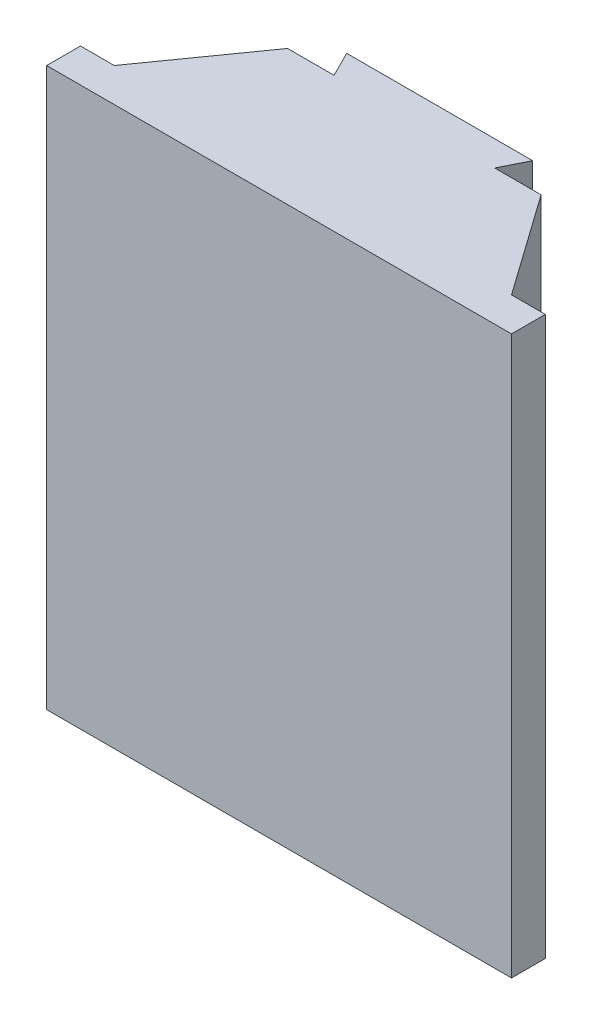
ISO-10303-21;
HEADER;
FILE_DESCRIPTION(('STEP AP214'),'2;1');
FILE_NAME('part.step','',(''),(''),'','','');
FILE_SCHEMA(('AUTOMOTIVE_DESIGN { 1 0 10303 214 1 1 1 1 }'));
ENDSEC;
DATA;
#1=APPLICATION_CONTEXT('core data for automotive mechanical design processes');
#2=APPLICATION_PROTOCOL_DEFINITION('international standard','automotive_design',2000,#1);
#3=PRODUCT_CONTEXT('',#1,'mechanical');
#4=PRODUCT('Part','Part','',(#3));
#5=PRODUCT_RELATED_PRODUCT_CATEGORY('part','',(#4));
#6=PRODUCT_DEFINITION_FORMATION('','',#4);
#7=PRODUCT_DEFINITION_CONTEXT('part definition',#1,'design');
#8=PRODUCT_DEFINITION('design','',#6,#7);
#9=PRODUCT_DEFINITION_SHAPE('','',#8);
#10=(LENGTH_UNIT() NAMED_UNIT(*) SI_UNIT(.MILLI.,.METRE.));
#11=(NAMED_UNIT(*) PLANE_ANGLE_UNIT() SI_UNIT($,.RADIAN.));
#12=(NAMED_UNIT(*) SI_UNIT($,.STERADIAN.) SOLID_ANGLE_UNIT());
#13=UNCERTAINTY_MEASURE_WITH_UNIT(LENGTH_MEASURE(1.E-05),#10,'distance_accuracy_value','');
#14=(GEOMETRIC_REPRESENTATION_CONTEXT(3) GLOBAL_UNCERTAINTY_ASSIGNED_CONTEXT((#13)) GLOBAL_UNIT_ASSIGNED_CONTEXT((#10,
#11,#12)) REPRESENTATION_CONTEXT('',''));
#15=CARTESIAN_POINT('',(0.,0.,0.));
#16=DIRECTION('',(0.,0.,1.));
#17=DIRECTION('',(1.,0.,0.));
#18=AXIS2_PLACEMENT_3D('',#15,#16,#17);
#19=CARTESIAN_POINT('',(-137.5,165.,156.));
#20=DIRECTION('',(1.,0.,0.));
#21=DIRECTION('',(0.,0.,-1.));
#22=AXIS2_PLACEMENT_3D('',#19,#20,#21);
#23=PLANE('',#22);
#24=DIRECTION('',(0.,0.,1.));
#25=VECTOR('',#24,1.);
#26=CARTESIAN_POINT('',(-137.5,-165.,156.));
#27=LINE('',#26,#25);
#28=CARTESIAN_POINT('',(-137.5,-165.,136.));
#29=VERTEX_POINT('',#28);
#30=CARTESIAN_POINT('',(-137.5,-165.,156.));
#31=VERTEX_POINT('',#30);
#32=EDGE_CURVE('E154',#29,#31,#27,.T.);
#33=ORIENTED_EDGE('',*,*,#32,.T.);
#34=DIRECTION('',(0.,-1.,0.));
#35=VECTOR('',#34,1.);
#36=CARTESIAN_POINT('',(-137.5,165.,156.));
#37=LINE('',#36,#35);
#38=CARTESIAN_POINT('',(-137.5,165.,156.));
#39=VERTEX_POINT('',#38);
#40=EDGE_CURVE('E11',#39,#31,#37,.T.);
#41=ORIENTED_EDGE('',*,*,#40,.F.);
#42=DIRECTION('',(0.,0.,1.));
#43=VECTOR('',#42,1.);
#44=CARTESIAN_POINT('',(-137.5,165.,156.));
#45=LINE('',#44,#43);
#46=CARTESIAN_POINT('',(-137.5,165.,136.));
#47=VERTEX_POINT('',#46);
#48=EDGE_CURVE('E176',#47,#39,#45,.T.);
#49=ORIENTED_EDGE('',*,*,#48,.F.);
#50=DIRECTION('',(0.,-1.,0.));
#51=VECTOR('',#50,1.);
#52=CARTESIAN_POINT('',(-137.5,165.,136.));
#53=LINE('',#52,#51);
#54=EDGE_CURVE('E150',#47,#29,#53,.T.);
#55=ORIENTED_EDGE('',*,*,#54,.T.);
#56=EDGE_LOOP('',(#33,#41,#49,#55));
#57=FACE_BOUND('',#56,.T.);
#58=ADVANCED_FACE('F34',(#57),#23,.F.);
#59=CARTESIAN_POINT('',(-137.5,165.,156.));
#60=DIRECTION('',(0.,0.,-1.));
#61=DIRECTION('',(-1.,0.,0.));
#62=AXIS2_PLACEMENT_3D('',#59,#60,#61);
#63=PLANE('',#62);
#64=DIRECTION('',(1.,0.,0.));
#65=VECTOR('',#64,1.);
#66=CARTESIAN_POINT('',(-137.5,-165.,156.));
#67=LINE('',#66,#65);
#68=CARTESIAN_POINT('',(137.5,-165.,156.));
#69=VERTEX_POINT('',#68);
#70=EDGE_CURVE('E157',#31,#69,#67,.T.);
#71=ORIENTED_EDGE('',*,*,#70,.T.);
#72=DIRECTION('',(0.,-1.,0.));
#73=VECTOR('',#72,1.);
#74=CARTESIAN_POINT('',(137.5,165.,156.));
#75=LINE('',#74,#73);
#76=CARTESIAN_POINT('',(137.5,165.,156.));
#77=VERTEX_POINT('',#76);
#78=EDGE_CURVE('E42',#77,#69,#75,.T.);
#79=ORIENTED_EDGE('',*,*,#78,.F.);
#80=DIRECTION('',(1.,0.,0.));
#81=VECTOR('',#80,1.);
#82=CARTESIAN_POINT('',(-137.5,165.,156.));
#83=LINE('',#82,#81);
#84=EDGE_CURVE('E105',#39,#77,#83,.T.);
#85=ORIENTED_EDGE('',*,*,#84,.F.);
#86=ORIENTED_EDGE('',*,*,#40,.T.);
#87=EDGE_LOOP('',(#71,#79,#85,#86));
#88=FACE_BOUND('',#87,.T.);
#89=ADVANCED_FACE('F254',(#88),#63,.F.);
#90=CARTESIAN_POINT('',(137.5,165.,156.));
#91=DIRECTION('',(-1.,0.,0.));
#92=DIRECTION('',(0.,0.,1.));
#93=AXIS2_PLACEMENT_3D('',#90,#91,#92);
#94=PLANE('',#93);
#95=DIRECTION('',(0.,0.,-1.));
#96=VECTOR('',#95,1.);
#97=CARTESIAN_POINT('',(137.5,-165.,156.));
#98=LINE('',#97,#96);
#99=CARTESIAN_POINT('',(137.5,-165.,136.));
#100=VERTEX_POINT('',#99);
#101=EDGE_CURVE('E159',#69,#100,#98,.T.);
#102=ORIENTED_EDGE('',*,*,#101,.T.);
#103=DIRECTION('',(0.,-1.,0.));
#104=VECTOR('',#103,1.);
#105=CARTESIAN_POINT('',(137.5,165.,136.));
#106=LINE('',#105,#104);
#107=CARTESIAN_POINT('',(137.5,165.,136.));
#108=VERTEX_POINT('',#107);
#109=EDGE_CURVE('E195',#108,#100,#106,.T.);
#110=ORIENTED_EDGE('',*,*,#109,.F.);
#111=DIRECTION('',(0.,0.,-1.));
#112=VECTOR('',#111,1.);
#113=CARTESIAN_POINT('',(137.5,165.,156.));
#114=LINE('',#113,#112);
#115=EDGE_CURVE('E203',#77,#108,#114,.T.);
#116=ORIENTED_EDGE('',*,*,#115,.F.);
#117=ORIENTED_EDGE('',*,*,#78,.T.);
#118=EDGE_LOOP('',(#102,#110,#116,#117));
#119=FACE_BOUND('',#118,.T.);
#120=ADVANCED_FACE('F201',(#119),#94,.F.);
#121=CARTESIAN_POINT('',(137.5,165.,136.));
#122=DIRECTION('',(0.,0.,1.));
#123=DIRECTION('',(1.,0.,0.));
#124=AXIS2_PLACEMENT_3D('',#121,#122,#123);
#125=PLANE('',#124);
#126=DIRECTION('',(-1.,0.,0.));
#127=VECTOR('',#126,1.);
#128=CARTESIAN_POINT('',(137.5,-165.,136.));
#129=LINE('',#128,#127);
#130=CARTESIAN_POINT('',(117.5,-165.,136.));
#131=VERTEX_POINT('',#130);
#132=EDGE_CURVE('E161',#100,#131,#129,.T.);
#133=ORIENTED_EDGE('',*,*,#132,.T.);
#134=DIRECTION('',(0.,-1.,0.));
#135=VECTOR('',#134,1.);
#136=CARTESIAN_POINT('',(117.5,165.,136.));
#137=LINE('',#136,#135);
#138=CARTESIAN_POINT('',(117.5,165.,136.));
#139=VERTEX_POINT('',#138);
#140=EDGE_CURVE('E192',#139,#131,#137,.T.);
#141=ORIENTED_EDGE('',*,*,#140,.F.);
#142=DIRECTION('',(-1.,0.,0.));
#143=VECTOR('',#142,1.);
#144=CARTESIAN_POINT('',(137.5,165.,136.));
#145=LINE('',#144,#143);
#146=EDGE_CURVE('E221',#108,#139,#145,.T.);
#147=ORIENTED_EDGE('',*,*,#146,.F.);
#148=ORIENTED_EDGE('',*,*,#109,.T.);
#149=EDGE_LOOP('',(#133,#141,#147,#148));
#150=FACE_BOUND('',#149,.T.);
#151=ADVANCED_FACE('F212',(#150),#125,.F.);
#152=CARTESIAN_POINT('',(117.5,165.,136.));
#153=DIRECTION('',(-0.816024481101655,0.,0.57801734078034));
#154=DIRECTION('',(0.57801734078034,0.,0.816024481101655));
#155=AXIS2_PLACEMENT_3D('',#152,#153,#154);
#156=PLANE('',#155);
#157=DIRECTION('',(-0.57801734078034,0.,-0.816024481101655));
#158=VECTOR('',#157,1.);
#159=CARTESIAN_POINT('',(117.5,-165.,136.));
#160=LINE('',#159,#158);
#161=CARTESIAN_POINT('',(75.,-165.,76.));
#162=VERTEX_POINT('',#161);
#163=EDGE_CURVE('E163',#131,#162,#160,.T.);
#164=ORIENTED_EDGE('',*,*,#163,.T.);
#165=DIRECTION('',(0.,-1.,0.));
#166=VECTOR('',#165,1.);
#167=CARTESIAN_POINT('',(75.,165.,76.));
#168=LINE('',#167,#166);
#169=CARTESIAN_POINT('',(75.,165.,76.));
#170=VERTEX_POINT('',#169);
#171=EDGE_CURVE('E189',#170,#162,#168,.T.);
#172=ORIENTED_EDGE('',*,*,#171,.F.);
#173=DIRECTION('',(-0.57801734078034,0.,-0.816024481101655));
#174=VECTOR('',#173,1.);
#175=CARTESIAN_POINT('',(117.5,165.,136.));
#176=LINE('',#175,#174);
#177=EDGE_CURVE('E218',#139,#170,#176,.T.);
#178=ORIENTED_EDGE('',*,*,#177,.F.);
#179=ORIENTED_EDGE('',*,*,#140,.T.);
#180=EDGE_LOOP('',(#164,#172,#178,#179));
#181=FACE_BOUND('',#180,.T.);
#182=ADVANCED_FACE('F216',(#181),#156,.F.);
#183=CARTESIAN_POINT('',(75.,165.,76.));
#184=DIRECTION('',(0.,0.,1.));
#185=DIRECTION('',(1.,0.,0.));
#186=AXIS2_PLACEMENT_3D('',#183,#184,#185);
#187=PLANE('',#186);
#188=DIRECTION('',(-1.,0.,0.));
#189=VECTOR('',#188,1.);
#190=CARTESIAN_POINT('',(75.,-165.,76.));
#191=LINE('',#190,#189);
#192=CARTESIAN_POINT('',(47.5,-165.,76.));
#193=VERTEX_POINT('',#192);
#194=EDGE_CURVE('E165',#162,#193,#191,.T.);
#195=ORIENTED_EDGE('',*,*,#194,.T.);
#196=DIRECTION('',(0.,-1.,0.));
#197=VECTOR('',#196,1.);
#198=CARTESIAN_POINT('',(47.5,165.,76.));
#199=LINE('',#198,#197);
#200=CARTESIAN_POINT('',(47.5,165.,76.));
#201=VERTEX_POINT('',#200);
#202=EDGE_CURVE('E186',#201,#193,#199,.T.);
#203=ORIENTED_EDGE('',*,*,#202,.F.);
#204=DIRECTION('',(-1.,0.,0.));
#205=VECTOR('',#204,1.);
#206=CARTESIAN_POINT('',(75.,165.,76.));
#207=LINE('',#206,#205);
#208=EDGE_CURVE('E220',#170,#201,#207,.T.);
#209=ORIENTED_EDGE('',*,*,#208,.F.);
#210=ORIENTED_EDGE('',*,*,#171,.T.);
#211=EDGE_LOOP('',(#195,#203,#209,#210));
#212=FACE_BOUND('',#211,.T.);
#213=ADVANCED_FACE('F267',(#212),#187,.F.);
#214=CARTESIAN_POINT('',(47.5,165.,76.));
#215=DIRECTION('',(-0.894427190999916,0.,-0.447213595499958));
#216=DIRECTION('',(-0.447213595499958,0.,0.894427190999916));
#217=AXIS2_PLACEMENT_3D('',#214,#215,#216);
#218=PLANE('',#217);
#219=DIRECTION('',(0.447213595499958,0.,-0.894427190999916));
#220=VECTOR('',#219,1.);
#221=CARTESIAN_POINT('',(47.5,-165.,76.));
#222=LINE('',#221,#220);
#223=CARTESIAN_POINT('',(55.,-165.,61.));
#224=VERTEX_POINT('',#223);
#225=EDGE_CURVE('E167',#193,#224,#222,.T.);
#226=ORIENTED_EDGE('',*,*,#225,.T.);
#227=DIRECTION('',(0.,-1.,0.));
#228=VECTOR('',#227,1.);
#229=CARTESIAN_POINT('',(55.,165.,61.));
#230=LINE('',#229,#228);
#231=CARTESIAN_POINT('',(55.,165.,61.));
#232=VERTEX_POINT('',#231);
#233=EDGE_CURVE('E183',#232,#224,#230,.T.);
#234=ORIENTED_EDGE('',*,*,#233,.F.);
#235=DIRECTION('',(0.447213595499958,0.,-0.894427190999916));
#236=VECTOR('',#235,1.);
#237=CARTESIAN_POINT('',(47.5,165.,76.));
#238=LINE('',#237,#236);
#239=EDGE_CURVE('E223',#201,#232,#238,.T.);
#240=ORIENTED_EDGE('',*,*,#239,.F.);
#241=ORIENTED_EDGE('',*,*,#202,.T.);
#242=EDGE_LOOP('',(#226,#234,#240,#241));
#243=FACE_BOUND('',#242,.T.);
#244=ADVANCED_FACE('F270',(#243),#218,.F.);
#245=CARTESIAN_POINT('',(55.,165.,61.));
#246=DIRECTION('',(0.,0.,1.));
#247=DIRECTION('',(1.,0.,0.));
#248=AXIS2_PLACEMENT_3D('',#245,#246,#247);
#249=PLANE('',#248);
#250=DIRECTION('',(-1.,0.,0.));
#251=VECTOR('',#250,1.);
#252=CARTESIAN_POINT('',(55.,-165.,61.));
#253=LINE('',#252,#251);
#254=CARTESIAN_POINT('',(-55.,-165.,61.));
#255=VERTEX_POINT('',#254);
#256=EDGE_CURVE('E169',#224,#255,#253,.T.);
#257=ORIENTED_EDGE('',*,*,#256,.T.);
#258=DIRECTION('',(0.,-1.,0.));
#259=VECTOR('',#258,1.);
#260=CARTESIAN_POINT('',(-55.,165.,61.));
#261=LINE('',#260,#259);
#262=CARTESIAN_POINT('',(-55.,165.,61.));
#263=VERTEX_POINT('',#262);
#264=EDGE_CURVE('E180',#263,#255,#261,.T.);
#265=ORIENTED_EDGE('',*,*,#264,.F.);
#266=DIRECTION('',(-1.,0.,0.));
#267=VECTOR('',#266,1.);
#268=CARTESIAN_POINT('',(55.,165.,61.));
#269=LINE('',#268,#267);
#270=EDGE_CURVE('E229',#232,#263,#269,.T.);
#271=ORIENTED_EDGE('',*,*,#270,.F.);
#272=ORIENTED_EDGE('',*,*,#233,.T.);
#273=EDGE_LOOP('',(#257,#265,#271,#272));
#274=FACE_BOUND('',#273,.T.);
#275=ADVANCED_FACE('F235',(#274),#249,.F.);
#276=CARTESIAN_POINT('',(-55.,165.,61.));
#277=DIRECTION('',(0.894427190999916,0.,-0.447213595499958));
#278=DIRECTION('',(-0.447213595499958,0.,-0.894427190999916));
#279=AXIS2_PLACEMENT_3D('',#276,#277,#278);
#280=PLANE('',#279);
#281=DIRECTION('',(0.447213595499958,0.,0.894427190999916));
#282=VECTOR('',#281,1.);
#283=CARTESIAN_POINT('',(-55.,-165.,61.));
#284=LINE('',#283,#282);
#285=CARTESIAN_POINT('',(-47.5,-165.,76.));
#286=VERTEX_POINT('',#285);
#287=EDGE_CURVE('E171',#255,#286,#284,.T.);
#288=ORIENTED_EDGE('',*,*,#287,.T.);
#289=DIRECTION('',(0.,-1.,0.));
#290=VECTOR('',#289,1.);
#291=CARTESIAN_POINT('',(-47.5,165.,76.));
#292=LINE('',#291,#290);
#293=CARTESIAN_POINT('',(-47.5,165.,76.));
#294=VERTEX_POINT('',#293);
#295=EDGE_CURVE('E145',#294,#286,#292,.T.);
#296=ORIENTED_EDGE('',*,*,#295,.F.);
#297=DIRECTION('',(0.447213595499958,0.,0.894427190999916));
#298=VECTOR('',#297,1.);
#299=CARTESIAN_POINT('',(-55.,165.,61.));
#300=LINE('',#299,#298);
#301=EDGE_CURVE('E136',#263,#294,#300,.T.);
#302=ORIENTED_EDGE('',*,*,#301,.F.);
#303=ORIENTED_EDGE('',*,*,#264,.T.);
#304=EDGE_LOOP('',(#288,#296,#302,#303));
#305=FACE_BOUND('',#304,.T.);
#306=ADVANCED_FACE('F239',(#305),#280,.F.);
#307=CARTESIAN_POINT('',(-47.5,165.,76.));
#308=DIRECTION('',(0.,0.,1.));
#309=DIRECTION('',(1.,0.,0.));
#310=AXIS2_PLACEMENT_3D('',#307,#308,#309);
#311=PLANE('',#310);
#312=DIRECTION('',(-1.,0.,0.));
#313=VECTOR('',#312,1.);
#314=CARTESIAN_POINT('',(-47.5,-165.,76.));
#315=LINE('',#314,#313);
#316=CARTESIAN_POINT('',(-75.,-165.,76.));
#317=VERTEX_POINT('',#316);
#318=EDGE_CURVE('E144',#286,#317,#315,.T.);
#319=ORIENTED_EDGE('',*,*,#318,.T.);
#320=DIRECTION('',(0.,-1.,0.));
#321=VECTOR('',#320,1.);
#322=CARTESIAN_POINT('',(-75.,165.,76.));
#323=LINE('',#322,#321);
#324=CARTESIAN_POINT('',(-75.,165.,76.));
#325=VERTEX_POINT('',#324);
#326=EDGE_CURVE('E141',#325,#317,#323,.T.);
#327=ORIENTED_EDGE('',*,*,#326,.F.);
#328=DIRECTION('',(-1.,0.,0.));
#329=VECTOR('',#328,1.);
#330=CARTESIAN_POINT('',(-47.5,165.,76.));
#331=LINE('',#330,#329);
#332=EDGE_CURVE('E130',#294,#325,#331,.T.);
#333=ORIENTED_EDGE('',*,*,#332,.F.);
#334=ORIENTED_EDGE('',*,*,#295,.T.);
#335=EDGE_LOOP('',(#319,#327,#333,#334));
#336=FACE_BOUND('',#335,.T.);
#337=ADVANCED_FACE('F142',(#336),#311,.F.);
#338=CARTESIAN_POINT('',(-117.5,165.,136.));
#339=DIRECTION('',(0.816024481101655,0.,0.578017340780339));
#340=DIRECTION('',(0.578017340780339,0.,-0.816024481101655));
#341=AXIS2_PLACEMENT_3D('',#338,#339,#340);
#342=PLANE('',#341);
#343=DIRECTION('',(-0.578017340780339,0.,0.816024481101655));
#344=VECTOR('',#343,1.);
#345=CARTESIAN_POINT('',(-117.5,-165.,136.));
#346=LINE('',#345,#344);
#347=CARTESIAN_POINT('',(-117.5,-165.,136.));
#348=VERTEX_POINT('',#347);
#349=EDGE_CURVE('E91',#317,#348,#346,.T.);
#350=ORIENTED_EDGE('',*,*,#349,.T.);
#351=DIRECTION('',(0.,-1.,0.));
#352=VECTOR('',#351,1.);
#353=CARTESIAN_POINT('',(-117.5,165.,136.));
#354=LINE('',#353,#352);
#355=CARTESIAN_POINT('',(-117.5,165.,136.));
#356=VERTEX_POINT('',#355);
#357=EDGE_CURVE('E146',#356,#348,#354,.T.);
#358=ORIENTED_EDGE('',*,*,#357,.F.);
#359=DIRECTION('',(-0.578017340780339,0.,0.816024481101655));
#360=VECTOR('',#359,1.);
#361=CARTESIAN_POINT('',(-117.5,165.,136.));
#362=LINE('',#361,#360);
#363=EDGE_CURVE('E134',#325,#356,#362,.T.);
#364=ORIENTED_EDGE('',*,*,#363,.F.);
#365=ORIENTED_EDGE('',*,*,#326,.T.);
#366=EDGE_LOOP('',(#350,#358,#364,#365));
#367=FACE_BOUND('',#366,.T.);
#368=ADVANCED_FACE('F148',(#367),#342,.F.);
#369=CARTESIAN_POINT('',(-137.5,165.,136.));
#370=DIRECTION('',(0.,0.,1.));
#371=DIRECTION('',(1.,0.,0.));
#372=AXIS2_PLACEMENT_3D('',#369,#370,#371);
#373=PLANE('',#372);
#374=DIRECTION('',(-1.,0.,0.));
#375=VECTOR('',#374,1.);
#376=CARTESIAN_POINT('',(-137.5,-165.,136.));
#377=LINE('',#376,#375);
#378=EDGE_CURVE('E97',#348,#29,#377,.T.);
#379=ORIENTED_EDGE('',*,*,#378,.T.);
#380=ORIENTED_EDGE('',*,*,#54,.F.);
#381=DIRECTION('',(-1.,0.,0.));
#382=VECTOR('',#381,1.);
#383=CARTESIAN_POINT('',(-137.5,165.,136.));
#384=LINE('',#383,#382);
#385=EDGE_CURVE('E50',#356,#47,#384,.T.);
#386=ORIENTED_EDGE('',*,*,#385,.F.);
#387=ORIENTED_EDGE('',*,*,#357,.T.);
#388=EDGE_LOOP('',(#379,#380,#386,#387));
#389=FACE_BOUND('',#388,.T.);
#390=ADVANCED_FACE('F243',(#389),#373,.F.);
#391=CARTESIAN_POINT('',(0.,165.,0.));
#392=DIRECTION('',(0.,-1.,0.));
#393=DIRECTION('',(0.,0.,-1.));
#394=AXIS2_PLACEMENT_3D('',#391,#392,#393);
#395=PLANE('',#394);
#396=ORIENTED_EDGE('',*,*,#48,.T.);
#397=ORIENTED_EDGE('',*,*,#84,.T.);
#398=ORIENTED_EDGE('',*,*,#115,.T.);
#399=ORIENTED_EDGE('',*,*,#146,.T.);
#400=ORIENTED_EDGE('',*,*,#177,.T.);
#401=ORIENTED_EDGE('',*,*,#208,.T.);
#402=ORIENTED_EDGE('',*,*,#239,.T.);
#403=ORIENTED_EDGE('',*,*,#270,.T.);
#404=ORIENTED_EDGE('',*,*,#301,.T.);
#405=ORIENTED_EDGE('',*,*,#332,.T.);
#406=ORIENTED_EDGE('',*,*,#363,.T.);
#407=ORIENTED_EDGE('',*,*,#385,.T.);
#408=EDGE_LOOP('',(#396,#397,#398,#399,#400,#401,#402,#403,#404,#405,#406,#407));
#409=FACE_BOUND('',#408,.T.);
#410=ADVANCED_FACE('F132',(#409),#395,.F.);
#411=CARTESIAN_POINT('',(0.,-165.,0.));
#412=DIRECTION('',(0.,-1.,0.));
#413=DIRECTION('',(0.,0.,-1.));
#414=AXIS2_PLACEMENT_3D('',#411,#412,#413);
#415=PLANE('',#414);
#416=ORIENTED_EDGE('',*,*,#32,.F.);
#417=ORIENTED_EDGE('',*,*,#378,.F.);
#418=ORIENTED_EDGE('',*,*,#349,.F.);
#419=ORIENTED_EDGE('',*,*,#318,.F.);
#420=ORIENTED_EDGE('',*,*,#287,.F.);
#421=ORIENTED_EDGE('',*,*,#256,.F.);
#422=ORIENTED_EDGE('',*,*,#225,.F.);
#423=ORIENTED_EDGE('',*,*,#194,.F.);
#424=ORIENTED_EDGE('',*,*,#163,.F.);
#425=ORIENTED_EDGE('',*,*,#132,.F.);
#426=ORIENTED_EDGE('',*,*,#101,.F.);
#427=ORIENTED_EDGE('',*,*,#70,.F.);
#428=EDGE_LOOP('',(#416,#417,#418,#419,#420,#421,#422,#423,#424,#425,#426,#427));
#429=FACE_BOUND('',#428,.T.);
#430=ADVANCED_FACE('F207',(#429),#415,.T.);
#431=CLOSED_SHELL('',(#58,#89,#120,#151,#182,#213,#244,#275,#306,#337,#368,#390,#410,#430));
#432=MANIFOLD_SOLID_BREP('B2',#431);
#433=ADVANCED_BREP_SHAPE_REPRESENTATION('',(#18,#432),#14);
#434=SHAPE_DEFINITION_REPRESENTATION(#9,#433);
ENDSEC;
END-ISO-10303-21;
